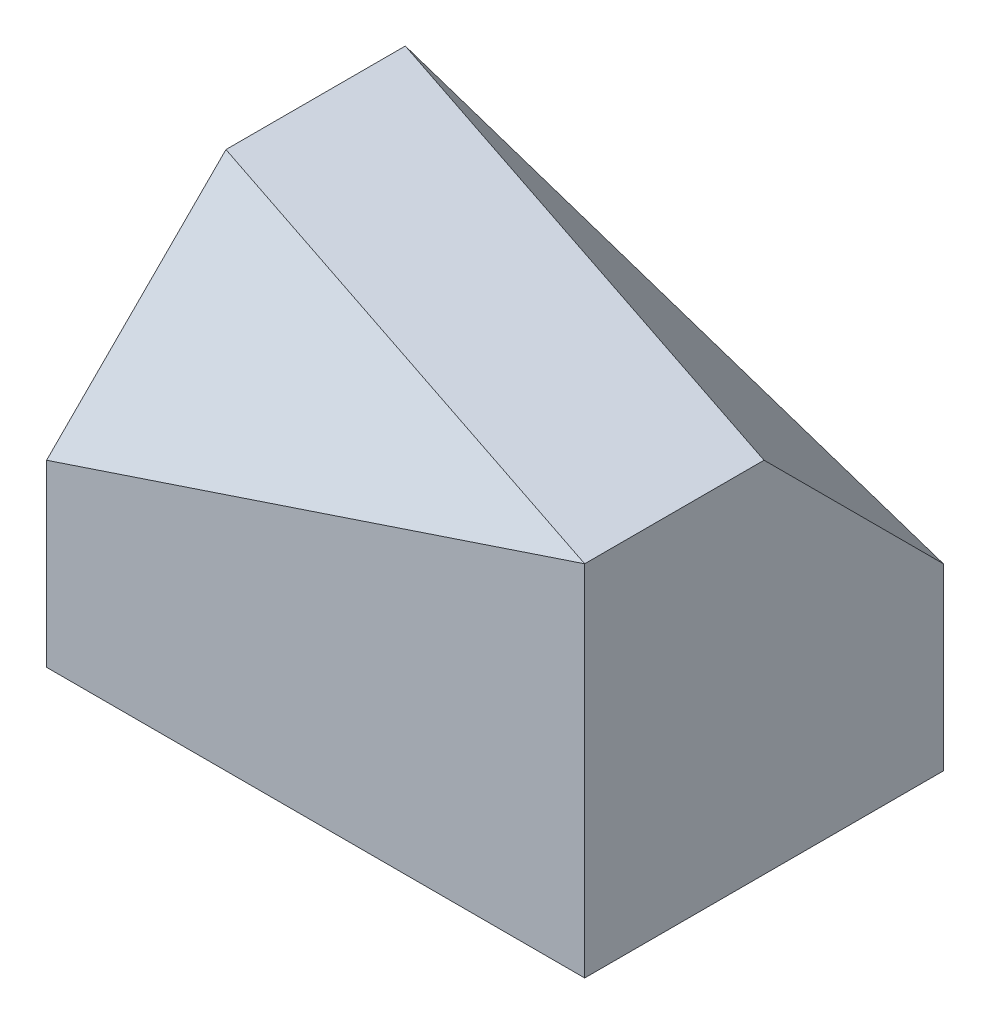
ISO-10303-21;
HEADER;
FILE_DESCRIPTION(('STEP AP214'),'2;1');
FILE_NAME('part.step','',(''),(''),'','','');
FILE_SCHEMA(('AUTOMOTIVE_DESIGN { 1 0 10303 214 1 1 1 1 }'));
ENDSEC;
DATA;
#1=APPLICATION_CONTEXT('core data for automotive mechanical design processes');
#2=APPLICATION_PROTOCOL_DEFINITION('international standard','automotive_design',2000,#1);
#3=PRODUCT_CONTEXT('',#1,'mechanical');
#4=PRODUCT('Part','Part','',(#3));
#5=PRODUCT_RELATED_PRODUCT_CATEGORY('part','',(#4));
#6=PRODUCT_DEFINITION_FORMATION('','',#4);
#7=PRODUCT_DEFINITION_CONTEXT('part definition',#1,'design');
#8=PRODUCT_DEFINITION('design','',#6,#7);
#9=PRODUCT_DEFINITION_SHAPE('','',#8);
#10=(LENGTH_UNIT() NAMED_UNIT(*) SI_UNIT(.MILLI.,.METRE.));
#11=(NAMED_UNIT(*) PLANE_ANGLE_UNIT() SI_UNIT($,.RADIAN.));
#12=(NAMED_UNIT(*) SI_UNIT($,.STERADIAN.) SOLID_ANGLE_UNIT());
#13=UNCERTAINTY_MEASURE_WITH_UNIT(LENGTH_MEASURE(1.E-05),#10,'distance_accuracy_value','');
#14=(GEOMETRIC_REPRESENTATION_CONTEXT(3) GLOBAL_UNCERTAINTY_ASSIGNED_CONTEXT((#13)) GLOBAL_UNIT_ASSIGNED_CONTEXT((#10,
#11,#12)) REPRESENTATION_CONTEXT('',''));
#15=CARTESIAN_POINT('',(0.,0.,0.));
#16=DIRECTION('',(0.,0.,1.));
#17=DIRECTION('',(1.,0.,0.));
#18=AXIS2_PLACEMENT_3D('',#15,#16,#17);
#19=CARTESIAN_POINT('',(2.99999999999999,4.,2.));
#20=DIRECTION('',(-1.,0.,0.));
#21=DIRECTION('',(0.,0.,1.));
#22=AXIS2_PLACEMENT_3D('',#19,#20,#21);
#23=PLANE('',#22);
#24=DIRECTION('',(0.,-0.707106781186548,-0.707106781186548));
#25=VECTOR('',#24,1.);
#26=CARTESIAN_POINT('',(2.99999999999999,5.,1.));
#27=LINE('',#26,#25);
#28=CARTESIAN_POINT('',(2.99999999999999,4.,0.));
#29=VERTEX_POINT('',#28);
#30=CARTESIAN_POINT('',(2.99999999999999,2.,-2.));
#31=VERTEX_POINT('',#30);
#32=EDGE_CURVE('E110',#29,#31,#27,.T.);
#33=ORIENTED_EDGE('',*,*,#32,.F.);
#34=DIRECTION('',(0.,0.,-1.));
#35=VECTOR('',#34,1.);
#36=CARTESIAN_POINT('',(2.99999999999999,4.,2.));
#37=LINE('',#36,#35);
#38=CARTESIAN_POINT('',(2.99999999999999,4.,2.));
#39=VERTEX_POINT('',#38);
#40=EDGE_CURVE('E97',#39,#29,#37,.T.);
#41=ORIENTED_EDGE('',*,*,#40,.F.);
#42=DIRECTION('',(0.,-1.,0.));
#43=VECTOR('',#42,1.);
#44=CARTESIAN_POINT('',(2.99999999999999,4.,2.));
#45=LINE('',#44,#43);
#46=CARTESIAN_POINT('',(2.99999999999999,0.,2.));
#47=VERTEX_POINT('',#46);
#48=EDGE_CURVE('E81',#39,#47,#45,.T.);
#49=ORIENTED_EDGE('',*,*,#48,.T.);
#50=DIRECTION('',(0.,0.,-1.));
#51=VECTOR('',#50,1.);
#52=CARTESIAN_POINT('',(2.99999999999999,0.,2.));
#53=LINE('',#52,#51);
#54=CARTESIAN_POINT('',(2.99999999999999,0.,-2.));
#55=VERTEX_POINT('',#54);
#56=EDGE_CURVE('E96',#47,#55,#53,.T.);
#57=ORIENTED_EDGE('',*,*,#56,.T.);
#58=DIRECTION('',(0.,-1.,0.));
#59=VECTOR('',#58,1.);
#60=CARTESIAN_POINT('',(2.99999999999999,4.,-2.));
#61=LINE('',#60,#59);
#62=EDGE_CURVE('E106',#31,#55,#61,.T.);
#63=ORIENTED_EDGE('',*,*,#62,.F.);
#64=EDGE_LOOP('',(#33,#41,#49,#57,#63));
#65=FACE_BOUND('',#64,.T.);
#66=ADVANCED_FACE('F33',(#65),#23,.F.);
#67=CARTESIAN_POINT('',(-3.00000000000001,4.,-2.));
#68=DIRECTION('',(0.,0.,1.));
#69=DIRECTION('',(1.,0.,0.));
#70=AXIS2_PLACEMENT_3D('',#67,#68,#69);
#71=PLANE('',#70);
#72=DIRECTION('',(-0.948683298050514,0.316227766016838,0.));
#73=VECTOR('',#72,1.);
#74=CARTESIAN_POINT('',(-3.00000000000001,4.,-2.));
#75=LINE('',#74,#73);
#76=CARTESIAN_POINT('',(-3.00000000000001,4.,-2.));
#77=VERTEX_POINT('',#76);
#78=EDGE_CURVE('E55',#31,#77,#75,.T.);
#79=ORIENTED_EDGE('',*,*,#78,.F.);
#80=ORIENTED_EDGE('',*,*,#62,.T.);
#81=DIRECTION('',(-1.,0.,0.));
#82=VECTOR('',#81,1.);
#83=CARTESIAN_POINT('',(-3.00000000000001,0.,-2.));
#84=LINE('',#83,#82);
#85=CARTESIAN_POINT('',(-3.00000000000001,0.,-2.));
#86=VERTEX_POINT('',#85);
#87=EDGE_CURVE('E91',#55,#86,#84,.T.);
#88=ORIENTED_EDGE('',*,*,#87,.T.);
#89=DIRECTION('',(0.,-1.,0.));
#90=VECTOR('',#89,1.);
#91=CARTESIAN_POINT('',(-3.00000000000001,4.,-2.));
#92=LINE('',#91,#90);
#93=EDGE_CURVE('E80',#77,#86,#92,.T.);
#94=ORIENTED_EDGE('',*,*,#93,.F.);
#95=EDGE_LOOP('',(#79,#80,#88,#94));
#96=FACE_BOUND('',#95,.T.);
#97=ADVANCED_FACE('F130',(#96),#71,.F.);
#98=CARTESIAN_POINT('',(0.,4.,0.));
#99=DIRECTION('',(0.,-1.,0.));
#100=DIRECTION('',(0.,0.,-1.));
#101=AXIS2_PLACEMENT_3D('',#98,#99,#100);
#102=PLANE('',#101);
#103=DIRECTION('',(0.,0.,1.));
#104=VECTOR('',#103,1.);
#105=CARTESIAN_POINT('',(-3.00000000000001,4.,2.));
#106=LINE('',#105,#104);
#107=CARTESIAN_POINT('',(-3.00000000000001,4.,0.));
#108=VERTEX_POINT('',#107);
#109=EDGE_CURVE('E100',#77,#108,#106,.T.);
#110=ORIENTED_EDGE('',*,*,#109,.T.);
#111=DIRECTION('',(0.948683298050514,0.,0.316227766016838));
#112=VECTOR('',#111,1.);
#113=CARTESIAN_POINT('',(-0.300000000000002,4.,0.900000000000005));
#114=LINE('',#113,#112);
#115=EDGE_CURVE('E121',#108,#39,#114,.T.);
#116=ORIENTED_EDGE('',*,*,#115,.T.);
#117=ORIENTED_EDGE('',*,*,#40,.T.);
#118=DIRECTION('',(0.948683298050514,0.,0.316227766016838));
#119=VECTOR('',#118,1.);
#120=CARTESIAN_POINT('',(0.299999999999998,4.,-0.899999999999995));
#121=LINE('',#120,#119);
#122=EDGE_CURVE('E40',#77,#29,#121,.T.);
#123=ORIENTED_EDGE('',*,*,#122,.F.);
#124=EDGE_LOOP('',(#110,#116,#117,#123));
#125=FACE_BOUND('',#124,.T.);
#126=ADVANCED_FACE('F120',(#125),#102,.F.);
#127=CARTESIAN_POINT('',(-3.00000000000001,4.,2.));
#128=DIRECTION('',(1.,0.,0.));
#129=DIRECTION('',(0.,0.,-1.));
#130=AXIS2_PLACEMENT_3D('',#127,#128,#129);
#131=PLANE('',#130);
#132=DIRECTION('',(0.,-1.,0.));
#133=VECTOR('',#132,1.);
#134=CARTESIAN_POINT('',(-3.00000000000001,4.,2.));
#135=LINE('',#134,#133);
#136=CARTESIAN_POINT('',(-3.00000000000001,2.,2.));
#137=VERTEX_POINT('',#136);
#138=CARTESIAN_POINT('',(-3.00000000000001,0.,2.));
#139=VERTEX_POINT('',#138);
#140=EDGE_CURVE('E72',#137,#139,#135,.T.);
#141=ORIENTED_EDGE('',*,*,#140,.F.);
#142=DIRECTION('',(0.,0.707106781186547,-0.707106781186548));
#143=VECTOR('',#142,1.);
#144=CARTESIAN_POINT('',(-3.00000000000001,3.,1.));
#145=LINE('',#144,#143);
#146=EDGE_CURVE('E47',#137,#108,#145,.T.);
#147=ORIENTED_EDGE('',*,*,#146,.T.);
#148=ORIENTED_EDGE('',*,*,#109,.F.);
#149=ORIENTED_EDGE('',*,*,#93,.T.);
#150=DIRECTION('',(0.,0.,1.));
#151=VECTOR('',#150,1.);
#152=CARTESIAN_POINT('',(-3.00000000000001,0.,2.));
#153=LINE('',#152,#151);
#154=EDGE_CURVE('E85',#86,#139,#153,.T.);
#155=ORIENTED_EDGE('',*,*,#154,.T.);
#156=EDGE_LOOP('',(#141,#147,#148,#149,#155));
#157=FACE_BOUND('',#156,.T.);
#158=ADVANCED_FACE('F86',(#157),#131,.F.);
#159=CARTESIAN_POINT('',(-3.00000000000001,4.,2.));
#160=DIRECTION('',(0.,0.,-1.));
#161=DIRECTION('',(-1.,0.,0.));
#162=AXIS2_PLACEMENT_3D('',#159,#160,#161);
#163=PLANE('',#162);
#164=ORIENTED_EDGE('',*,*,#48,.F.);
#165=DIRECTION('',(-0.948683298050514,-0.316227766016838,0.));
#166=VECTOR('',#165,1.);
#167=CARTESIAN_POINT('',(-2.40000000000001,2.2,2.));
#168=LINE('',#167,#166);
#169=EDGE_CURVE('E11',#39,#137,#168,.T.);
#170=ORIENTED_EDGE('',*,*,#169,.T.);
#171=ORIENTED_EDGE('',*,*,#140,.T.);
#172=DIRECTION('',(1.,0.,0.));
#173=VECTOR('',#172,1.);
#174=CARTESIAN_POINT('',(-3.00000000000001,0.,2.));
#175=LINE('',#174,#173);
#176=EDGE_CURVE('E77',#139,#47,#175,.T.);
#177=ORIENTED_EDGE('',*,*,#176,.T.);
#178=EDGE_LOOP('',(#164,#170,#171,#177));
#179=FACE_BOUND('',#178,.T.);
#180=ADVANCED_FACE('F75',(#179),#163,.F.);
#181=CARTESIAN_POINT('',(0.,0.,0.));
#182=DIRECTION('',(0.,-1.,0.));
#183=DIRECTION('',(0.,0.,-1.));
#184=AXIS2_PLACEMENT_3D('',#181,#182,#183);
#185=PLANE('',#184);
#186=ORIENTED_EDGE('',*,*,#56,.F.);
#187=ORIENTED_EDGE('',*,*,#176,.F.);
#188=ORIENTED_EDGE('',*,*,#154,.F.);
#189=ORIENTED_EDGE('',*,*,#87,.F.);
#190=EDGE_LOOP('',(#186,#187,#188,#189));
#191=FACE_BOUND('',#190,.T.);
#192=ADVANCED_FACE('F94',(#191),#185,.T.);
#193=CARTESIAN_POINT('',(0.789473684210526,2.36842105263158,-2.36842105263158));
#194=DIRECTION('',(0.229415733870562,0.688247201611685,-0.688247201611685));
#195=DIRECTION('',(0.,0.707106781186548,0.707106781186548));
#196=AXIS2_PLACEMENT_3D('',#193,#194,#195);
#197=PLANE('',#196);
#198=ORIENTED_EDGE('',*,*,#32,.T.);
#199=ORIENTED_EDGE('',*,*,#78,.T.);
#200=ORIENTED_EDGE('',*,*,#122,.T.);
#201=EDGE_LOOP('',(#198,#199,#200));
#202=FACE_BOUND('',#201,.T.);
#203=ADVANCED_FACE('F109',(#202),#197,.T.);
#204=CARTESIAN_POINT('',(-0.789473684210528,2.36842105263158,2.36842105263158));
#205=DIRECTION('',(0.229415733870562,-0.688247201611686,-0.688247201611685));
#206=DIRECTION('',(0.,0.707106781186547,-0.707106781186548));
#207=AXIS2_PLACEMENT_3D('',#204,#205,#206);
#208=PLANE('',#207);
#209=ORIENTED_EDGE('',*,*,#146,.F.);
#210=ORIENTED_EDGE('',*,*,#169,.F.);
#211=ORIENTED_EDGE('',*,*,#115,.F.);
#212=EDGE_LOOP('',(#209,#210,#211));
#213=FACE_BOUND('',#212,.T.);
#214=ADVANCED_FACE('F146',(#213),#208,.F.);
#215=CLOSED_SHELL('',(#66,#97,#126,#158,#180,#192,#203,#214));
#216=MANIFOLD_SOLID_BREP('B2',#215);
#217=ADVANCED_BREP_SHAPE_REPRESENTATION('',(#18,#216),#14);
#218=SHAPE_DEFINITION_REPRESENTATION(#9,#217);
ENDSEC;
END-ISO-10303-21;
